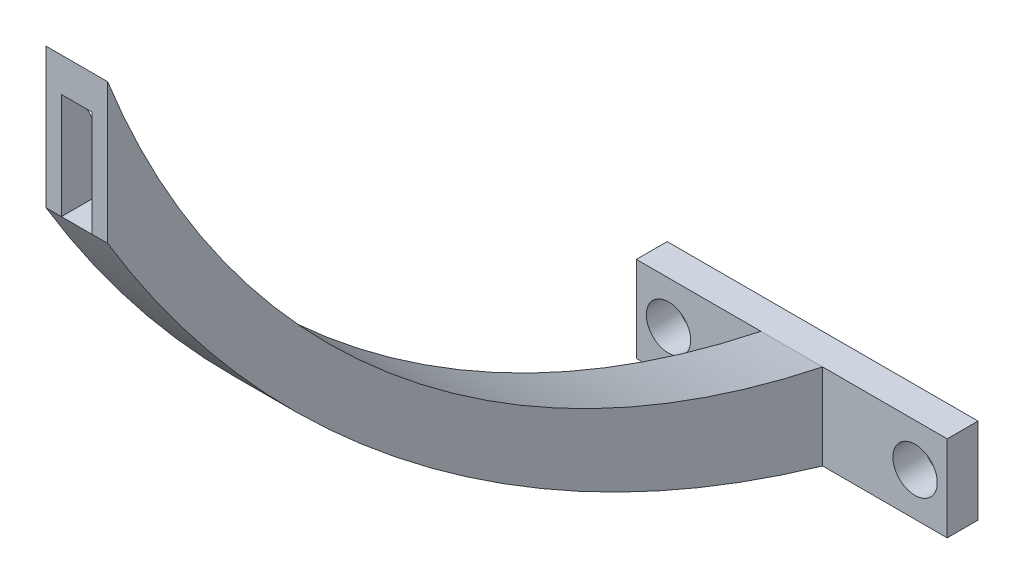
ISO-10303-21;
HEADER;
FILE_DESCRIPTION(('STEP AP214'),'2;1');
FILE_NAME('part.step','',(''),(''),'','','');
FILE_SCHEMA(('AUTOMOTIVE_DESIGN { 1 0 10303 214 1 1 1 1 }'));
ENDSEC;
DATA;
#1=APPLICATION_CONTEXT('core data for automotive mechanical design processes');
#2=APPLICATION_PROTOCOL_DEFINITION('international standard','automotive_design',2000,#1);
#3=PRODUCT_CONTEXT('',#1,'mechanical');
#4=PRODUCT('Part','Part','',(#3));
#5=PRODUCT_RELATED_PRODUCT_CATEGORY('part','',(#4));
#6=PRODUCT_DEFINITION_FORMATION('','',#4);
#7=PRODUCT_DEFINITION_CONTEXT('part definition',#1,'design');
#8=PRODUCT_DEFINITION('design','',#6,#7);
#9=PRODUCT_DEFINITION_SHAPE('','',#8);
#10=(LENGTH_UNIT() NAMED_UNIT(*) SI_UNIT(.MILLI.,.METRE.));
#11=(NAMED_UNIT(*) PLANE_ANGLE_UNIT() SI_UNIT($,.RADIAN.));
#12=(NAMED_UNIT(*) SI_UNIT($,.STERADIAN.) SOLID_ANGLE_UNIT());
#13=UNCERTAINTY_MEASURE_WITH_UNIT(LENGTH_MEASURE(1.E-05),#10,'distance_accuracy_value','');
#14=(GEOMETRIC_REPRESENTATION_CONTEXT(3) GLOBAL_UNCERTAINTY_ASSIGNED_CONTEXT((#13)) GLOBAL_UNIT_ASSIGNED_CONTEXT((#10,
#11,#12)) REPRESENTATION_CONTEXT('',''));
#15=CARTESIAN_POINT('',(0.,0.,0.));
#16=DIRECTION('',(0.,0.,1.));
#17=DIRECTION('',(1.,0.,0.));
#18=AXIS2_PLACEMENT_3D('',#15,#16,#17);
#19=CARTESIAN_POINT('',(1.58750000000001,0.,2.54));
#20=DIRECTION('',(-1.,0.,0.));
#21=DIRECTION('',(0.,0.,1.));
#22=AXIS2_PLACEMENT_3D('',#19,#20,#21);
#23=PLANE('',#22);
#24=DIRECTION('',(0.,0.,-1.));
#25=VECTOR('',#24,1.);
#26=CARTESIAN_POINT('',(1.58750000000001,67.5961503717204,73.66));
#27=LINE('',#26,#25);
#28=CARTESIAN_POINT('',(1.58750000000001,67.5961503717204,73.66));
#29=VERTEX_POINT('',#28);
#30=CARTESIAN_POINT('',(1.58750000000001,67.5961503717204,72.2017926374648));
#31=VERTEX_POINT('',#30);
#32=EDGE_CURVE('E159',#29,#31,#27,.T.);
#33=ORIENTED_EDGE('',*,*,#32,.F.);
#34=DIRECTION('',(0.,-1.,0.));
#35=VECTOR('',#34,1.);
#36=CARTESIAN_POINT('',(1.58750000000001,0.,73.66));
#37=LINE('',#36,#35);
#38=CARTESIAN_POINT('',(1.58750000000001,56.697947674241,73.66));
#39=VERTEX_POINT('',#38);
#40=EDGE_CURVE('E148',#29,#39,#37,.T.);
#41=ORIENTED_EDGE('',*,*,#40,.T.);
#42=DIRECTION('',(0.,0.,1.));
#43=VECTOR('',#42,1.);
#44=CARTESIAN_POINT('',(1.58750000000001,56.697947674241,2.54));
#45=LINE('',#44,#43);
#46=CARTESIAN_POINT('',(1.58750000000001,56.697947674241,66.6457203813951));
#47=VERTEX_POINT('',#46);
#48=EDGE_CURVE('E226',#47,#39,#45,.T.);
#49=ORIENTED_EDGE('',*,*,#48,.F.);
#50=CARTESIAN_POINT('',(1.58750000000001,108.146776817647,-20.8044360752679));
#51=DIRECTION('',(-1.,0.,0.));
#52=DIRECTION('',(0.,0.,1.));
#53=AXIS2_PLACEMENT_3D('',#50,#51,#52);
#54=CIRCLE('',#53,101.461874044008);
#55=EDGE_CURVE('E61',#31,#47,#54,.F.);
#56=ORIENTED_EDGE('',*,*,#55,.F.);
#57=EDGE_LOOP('',(#33,#41,#49,#56));
#58=FACE_BOUND('',#57,.T.);
#59=ADVANCED_FACE('F53',(#58),#23,.F.);
#60=CARTESIAN_POINT('',(4.76250000000003,0.,2.54));
#61=DIRECTION('',(-1.,0.,0.));
#62=DIRECTION('',(0.,-1.,0.));
#63=AXIS2_PLACEMENT_3D('',#60,#61,#62);
#64=PLANE('',#63);
#65=DIRECTION('',(0.,-1.,0.));
#66=VECTOR('',#65,1.);
#67=CARTESIAN_POINT('',(4.76250000000003,0.,73.66));
#68=LINE('',#67,#66);
#69=CARTESIAN_POINT('',(4.76250000000001,67.5961503717204,73.66));
#70=VERTEX_POINT('',#69);
#71=CARTESIAN_POINT('',(4.76250000000001,56.697947674241,73.66));
#72=VERTEX_POINT('',#71);
#73=EDGE_CURVE('E156',#70,#72,#68,.T.);
#74=ORIENTED_EDGE('',*,*,#73,.F.);
#75=DIRECTION('',(0.,0.,1.));
#76=VECTOR('',#75,1.);
#77=CARTESIAN_POINT('',(4.76250000000001,67.5961503717204,73.66));
#78=LINE('',#77,#76);
#79=CARTESIAN_POINT('',(4.76250000000001,67.5961503717204,72.2017926374648));
#80=VERTEX_POINT('',#79);
#81=EDGE_CURVE('E74',#80,#70,#78,.T.);
#82=ORIENTED_EDGE('',*,*,#81,.F.);
#83=CARTESIAN_POINT('',(4.7625,108.146776817647,-20.8044360752679));
#84=DIRECTION('',(-1.,0.,0.));
#85=DIRECTION('',(0.,-1.,0.));
#86=AXIS2_PLACEMENT_3D('',#83,#84,#85);
#87=CIRCLE('',#86,101.461874044008);
#88=CARTESIAN_POINT('',(4.76250000000002,56.697947674241,66.6457203813951));
#89=VERTEX_POINT('',#88);
#90=EDGE_CURVE('E261',#80,#89,#87,.F.);
#91=ORIENTED_EDGE('',*,*,#90,.T.);
#92=DIRECTION('',(0.,0.,1.));
#93=VECTOR('',#92,1.);
#94=CARTESIAN_POINT('',(4.76250000000001,56.697947674241,2.54));
#95=LINE('',#94,#93);
#96=EDGE_CURVE('E155',#89,#72,#95,.T.);
#97=ORIENTED_EDGE('',*,*,#96,.T.);
#98=EDGE_LOOP('',(#74,#82,#91,#97));
#99=FACE_BOUND('',#98,.T.);
#100=ADVANCED_FACE('F276',(#99),#64,.T.);
#101=CARTESIAN_POINT('',(0.,71.12,0.));
#102=DIRECTION('',(1.,0.,0.));
#103=DIRECTION('',(0.,0.,-1.));
#104=AXIS2_PLACEMENT_3D('',#101,#102,#103);
#105=PLANE('',#104);
#106=DIRECTION('',(0.,-1.,0.));
#107=VECTOR('',#106,1.);
#108=CARTESIAN_POINT('',(0.,71.12,73.66));
#109=LINE('',#108,#107);
#110=CARTESIAN_POINT('',(0.,71.12,73.66));
#111=VERTEX_POINT('',#110);
#112=CARTESIAN_POINT('',(0.,56.697947674241,73.66));
#113=VERTEX_POINT('',#112);
#114=EDGE_CURVE('E259',#111,#113,#109,.T.);
#115=ORIENTED_EDGE('',*,*,#114,.F.);
#116=CARTESIAN_POINT('',(0.,108.146776817647,-20.8044360752679));
#117=DIRECTION('',(1.,0.,0.));
#118=DIRECTION('',(0.,0.,-1.));
#119=AXIS2_PLACEMENT_3D('',#116,#117,#118);
#120=CIRCLE('',#119,101.461874044008);
#121=CARTESIAN_POINT('',(0.,8.84074817833277,0.));
#122=VERTEX_POINT('',#121);
#123=EDGE_CURVE('E241',#111,#122,#120,.T.);
#124=ORIENTED_EDGE('',*,*,#123,.T.);
#125=DIRECTION('',(0.,-1.,0.));
#126=VECTOR('',#125,1.);
#127=CARTESIAN_POINT('',(0.,71.12,0.));
#128=LINE('',#127,#126);
#129=CARTESIAN_POINT('',(0.,0.,0.));
#130=VERTEX_POINT('',#129);
#131=EDGE_CURVE('E247',#122,#130,#128,.T.);
#132=ORIENTED_EDGE('',*,*,#131,.T.);
#133=CARTESIAN_POINT('',(0.,122.26025229399,-35.4558641320756));
#134=DIRECTION('',(1.,0.,0.));
#135=DIRECTION('',(0.,0.,-1.));
#136=AXIS2_PLACEMENT_3D('',#133,#134,#135);
#137=CIRCLE('',#136,127.297633883519);
#138=EDGE_CURVE('E239',#113,#130,#137,.T.);
#139=ORIENTED_EDGE('',*,*,#138,.F.);
#140=EDGE_LOOP('',(#115,#124,#132,#139));
#141=FACE_BOUND('',#140,.T.);
#142=ADVANCED_FACE('F55',(#141),#105,.F.);
#143=CARTESIAN_POINT('',(0.,71.12,73.66));
#144=DIRECTION('',(0.,0.,-1.));
#145=DIRECTION('',(-1.,0.,0.));
#146=AXIS2_PLACEMENT_3D('',#143,#144,#145);
#147=PLANE('',#146);
#148=DIRECTION('',(1.,0.,0.));
#149=VECTOR('',#148,1.);
#150=CARTESIAN_POINT('',(-64.77,56.697947674241,73.66));
#151=LINE('',#150,#149);
#152=EDGE_CURVE('E153',#113,#39,#151,.T.);
#153=ORIENTED_EDGE('',*,*,#152,.T.);
#154=ORIENTED_EDGE('',*,*,#40,.F.);
#155=DIRECTION('',(-1.,0.,0.));
#156=VECTOR('',#155,1.);
#157=CARTESIAN_POINT('',(8.57614457112592,67.5961503717204,73.66));
#158=LINE('',#157,#156);
#159=EDGE_CURVE('E150',#70,#29,#158,.T.);
#160=ORIENTED_EDGE('',*,*,#159,.F.);
#161=ORIENTED_EDGE('',*,*,#73,.T.);
#162=CARTESIAN_POINT('',(6.35000000000001,56.697947674241,73.66));
#163=VERTEX_POINT('',#162);
#164=EDGE_CURVE('E237',#72,#163,#151,.T.);
#165=ORIENTED_EDGE('',*,*,#164,.T.);
#166=DIRECTION('',(0.,-1.,0.));
#167=VECTOR('',#166,1.);
#168=CARTESIAN_POINT('',(6.35000000000001,71.12,73.66));
#169=LINE('',#168,#167);
#170=CARTESIAN_POINT('',(6.35000000000001,71.12,73.66));
#171=VERTEX_POINT('',#170);
#172=EDGE_CURVE('E256',#171,#163,#169,.T.);
#173=ORIENTED_EDGE('',*,*,#172,.F.);
#174=DIRECTION('',(1.,0.,0.));
#175=VECTOR('',#174,1.);
#176=CARTESIAN_POINT('',(0.,71.12,73.66));
#177=LINE('',#176,#175);
#178=CARTESIAN_POINT('',(4.76250000000001,71.12,73.66));
#179=VERTEX_POINT('',#178);
#180=EDGE_CURVE('E248',#179,#171,#177,.T.);
#181=ORIENTED_EDGE('',*,*,#180,.F.);
#182=DIRECTION('',(-1.,0.,0.));
#183=VECTOR('',#182,1.);
#184=CARTESIAN_POINT('',(8.57614457112592,71.12,73.66));
#185=LINE('',#184,#183);
#186=CARTESIAN_POINT('',(1.58750000000001,71.12,73.66));
#187=VERTEX_POINT('',#186);
#188=EDGE_CURVE('E170',#179,#187,#185,.T.);
#189=ORIENTED_EDGE('',*,*,#188,.T.);
#190=EDGE_CURVE('E245',#111,#187,#177,.T.);
#191=ORIENTED_EDGE('',*,*,#190,.F.);
#192=ORIENTED_EDGE('',*,*,#114,.T.);
#193=EDGE_LOOP('',(#153,#154,#160,#161,#165,#173,#181,#189,#191,#192));
#194=FACE_BOUND('',#193,.T.);
#195=ADVANCED_FACE('F149',(#194),#147,.F.);
#196=CARTESIAN_POINT('',(6.35,71.12,0.));
#197=DIRECTION('',(-1.,0.,0.));
#198=DIRECTION('',(0.,0.,1.));
#199=AXIS2_PLACEMENT_3D('',#196,#197,#198);
#200=PLANE('',#199);
#201=DIRECTION('',(0.,-1.,0.));
#202=VECTOR('',#201,1.);
#203=CARTESIAN_POINT('',(6.35,71.12,0.));
#204=LINE('',#203,#202);
#205=CARTESIAN_POINT('',(6.35,8.84074817833277,0.));
#206=VERTEX_POINT('',#205);
#207=CARTESIAN_POINT('',(6.35,0.,0.));
#208=VERTEX_POINT('',#207);
#209=EDGE_CURVE('E253',#206,#208,#204,.T.);
#210=ORIENTED_EDGE('',*,*,#209,.F.);
#211=CARTESIAN_POINT('',(6.35,108.146776817647,-20.8044360752679));
#212=DIRECTION('',(1.,0.,0.));
#213=DIRECTION('',(0.,0.,-1.));
#214=AXIS2_PLACEMENT_3D('',#211,#212,#213);
#215=CIRCLE('',#214,101.461874044008);
#216=EDGE_CURVE('E228',#171,#206,#215,.T.);
#217=ORIENTED_EDGE('',*,*,#216,.F.);
#218=ORIENTED_EDGE('',*,*,#172,.T.);
#219=CARTESIAN_POINT('',(6.35,122.26025229399,-35.4558641320756));
#220=DIRECTION('',(1.,0.,0.));
#221=DIRECTION('',(0.,0.,-1.));
#222=AXIS2_PLACEMENT_3D('',#219,#220,#221);
#223=CIRCLE('',#222,127.297633883519);
#224=EDGE_CURVE('E235',#163,#208,#223,.T.);
#225=ORIENTED_EDGE('',*,*,#224,.T.);
#226=EDGE_LOOP('',(#210,#217,#218,#225));
#227=FACE_BOUND('',#226,.T.);
#228=ADVANCED_FACE('F289',(#227),#200,.F.);
#229=CARTESIAN_POINT('',(-64.77,122.26025229399,-35.4558641320756));
#230=DIRECTION('',(1.,0.,0.));
#231=DIRECTION('',(0.,0.,-1.));
#232=AXIS2_PLACEMENT_3D('',#229,#230,#231);
#233=CYLINDRICAL_SURFACE('',#232,127.297633883519);
#234=ORIENTED_EDGE('',*,*,#138,.T.);
#235=DIRECTION('',(-1.,0.,0.));
#236=VECTOR('',#235,1.);
#237=CARTESIAN_POINT('',(0.,0.,0.));
#238=LINE('',#237,#236);
#239=EDGE_CURVE('E244',#208,#130,#238,.T.);
#240=ORIENTED_EDGE('',*,*,#239,.F.);
#241=ORIENTED_EDGE('',*,*,#224,.F.);
#242=ORIENTED_EDGE('',*,*,#164,.F.);
#243=DIRECTION('',(1.,0.,0.));
#244=VECTOR('',#243,1.);
#245=CARTESIAN_POINT('',(0.,56.697947674241,73.66));
#246=LINE('',#245,#244);
#247=EDGE_CURVE('E222',#39,#72,#246,.T.);
#248=ORIENTED_EDGE('',*,*,#247,.F.);
#249=ORIENTED_EDGE('',*,*,#152,.F.);
#250=EDGE_LOOP('',(#234,#240,#241,#242,#248,#249));
#251=FACE_BOUND('',#250,.T.);
#252=ADVANCED_FACE('F312',(#251),#233,.T.);
#253=CARTESIAN_POINT('',(-64.77,108.146776817647,-20.8044360752679));
#254=DIRECTION('',(1.,0.,0.));
#255=DIRECTION('',(0.,0.,-1.));
#256=AXIS2_PLACEMENT_3D('',#253,#254,#255);
#257=CYLINDRICAL_SURFACE('',#256,101.461874044008);
#258=ORIENTED_EDGE('',*,*,#190,.T.);
#259=EDGE_CURVE('E12',#187,#31,#54,.F.);
#260=ORIENTED_EDGE('',*,*,#259,.T.);
#261=ORIENTED_EDGE('',*,*,#55,.T.);
#262=DIRECTION('',(1.,0.,0.));
#263=VECTOR('',#262,1.);
#264=CARTESIAN_POINT('',(-64.77,56.697947674241,66.6457203813951));
#265=LINE('',#264,#263);
#266=EDGE_CURVE('E263',#47,#89,#265,.T.);
#267=ORIENTED_EDGE('',*,*,#266,.T.);
#268=ORIENTED_EDGE('',*,*,#90,.F.);
#269=EDGE_CURVE('E262',#179,#80,#87,.F.);
#270=ORIENTED_EDGE('',*,*,#269,.F.);
#271=ORIENTED_EDGE('',*,*,#180,.T.);
#272=ORIENTED_EDGE('',*,*,#216,.T.);
#273=DIRECTION('',(1.,0.,0.));
#274=VECTOR('',#273,1.);
#275=CARTESIAN_POINT('',(-64.77,8.84074817833277,0.));
#276=LINE('',#275,#274);
#277=EDGE_CURVE('E232',#122,#206,#276,.T.);
#278=ORIENTED_EDGE('',*,*,#277,.F.);
#279=ORIENTED_EDGE('',*,*,#123,.F.);
#280=EDGE_LOOP('',(#258,#260,#261,#267,#268,#270,#271,#272,#278,#279));
#281=FACE_BOUND('',#280,.T.);
#282=ADVANCED_FACE('F268',(#281),#257,.F.);
#283=CARTESIAN_POINT('',(0.,56.697947674241,2.54));
#284=DIRECTION('',(0.,-1.,0.));
#285=DIRECTION('',(0.,0.,-1.));
#286=AXIS2_PLACEMENT_3D('',#283,#284,#285);
#287=PLANE('',#286);
#288=ORIENTED_EDGE('',*,*,#48,.T.);
#289=ORIENTED_EDGE('',*,*,#247,.T.);
#290=ORIENTED_EDGE('',*,*,#96,.F.);
#291=ORIENTED_EDGE('',*,*,#266,.F.);
#292=EDGE_LOOP('',(#288,#289,#290,#291));
#293=FACE_BOUND('',#292,.T.);
#294=ADVANCED_FACE('F272',(#293),#287,.F.);
#295=CARTESIAN_POINT('',(0.,0.,0.));
#296=DIRECTION('',(0.,0.,-1.));
#297=DIRECTION('',(-1.,0.,0.));
#298=AXIS2_PLACEMENT_3D('',#295,#296,#297);
#299=PLANE('',#298);
#300=CARTESIAN_POINT('',(15.875,4.42037408916639,0.));
#301=DIRECTION('',(0.,0.,-1.));
#302=DIRECTION('',(-1.,0.,0.));
#303=AXIS2_PLACEMENT_3D('',#300,#301,#302);
#304=CIRCLE('',#303,2.286);
#305=CARTESIAN_POINT('',(13.589,4.42037408916639,0.));
#306=VERTEX_POINT('',#305);
#307=EDGE_CURVE('E207',#306,#306,#304,.T.);
#308=ORIENTED_EDGE('',*,*,#307,.T.);
#309=EDGE_LOOP('',(#308));
#310=FACE_BOUND('',#309,.T.);
#311=DIRECTION('',(1.,0.,0.));
#312=VECTOR('',#311,1.);
#313=CARTESIAN_POINT('',(0.,8.84074817833277,0.));
#314=LINE('',#313,#312);
#315=CARTESIAN_POINT('',(19.1866851716327,8.84074817833277,0.));
#316=VERTEX_POINT('',#315);
#317=EDGE_CURVE('E196',#206,#316,#314,.T.);
#318=ORIENTED_EDGE('',*,*,#317,.F.);
#319=ORIENTED_EDGE('',*,*,#209,.T.);
#320=DIRECTION('',(1.,0.,0.));
#321=VECTOR('',#320,1.);
#322=CARTESIAN_POINT('',(0.,0.,0.));
#323=LINE('',#322,#321);
#324=CARTESIAN_POINT('',(19.1866851716327,0.,0.));
#325=VERTEX_POINT('',#324);
#326=EDGE_CURVE('E203',#208,#325,#323,.T.);
#327=ORIENTED_EDGE('',*,*,#326,.T.);
#328=DIRECTION('',(0.,1.,0.));
#329=VECTOR('',#328,1.);
#330=CARTESIAN_POINT('',(19.1866851716327,0.,0.));
#331=LINE('',#330,#329);
#332=EDGE_CURVE('E200',#325,#316,#331,.T.);
#333=ORIENTED_EDGE('',*,*,#332,.T.);
#334=EDGE_LOOP('',(#318,#319,#327,#333));
#335=FACE_BOUND('',#334,.T.);
#336=ADVANCED_FACE('F314',(#310,#335),#299,.F.);
#337=CARTESIAN_POINT('',(-12.8366851716327,0.,-3.175));
#338=DIRECTION('',(1.,0.,0.));
#339=DIRECTION('',(0.,0.,-1.));
#340=AXIS2_PLACEMENT_3D('',#337,#338,#339);
#341=PLANE('',#340);
#342=DIRECTION('',(0.,1.,0.));
#343=VECTOR('',#342,1.);
#344=CARTESIAN_POINT('',(-12.8366851716327,0.,0.));
#345=LINE('',#344,#343);
#346=CARTESIAN_POINT('',(-12.8366851716327,0.,0.));
#347=VERTEX_POINT('',#346);
#348=CARTESIAN_POINT('',(-12.8366851716327,8.84074817833277,0.));
#349=VERTEX_POINT('',#348);
#350=EDGE_CURVE('E193',#347,#349,#345,.T.);
#351=ORIENTED_EDGE('',*,*,#350,.T.);
#352=DIRECTION('',(0.,0.,1.));
#353=VECTOR('',#352,1.);
#354=CARTESIAN_POINT('',(-12.8366851716327,8.84074817833277,-3.175));
#355=LINE('',#354,#353);
#356=CARTESIAN_POINT('',(-12.8366851716327,8.84074817833277,-3.175));
#357=VERTEX_POINT('',#356);
#358=EDGE_CURVE('E219',#357,#349,#355,.T.);
#359=ORIENTED_EDGE('',*,*,#358,.F.);
#360=DIRECTION('',(0.,1.,0.));
#361=VECTOR('',#360,1.);
#362=CARTESIAN_POINT('',(-12.8366851716327,0.,-3.175));
#363=LINE('',#362,#361);
#364=CARTESIAN_POINT('',(-12.8366851716327,0.,-3.175));
#365=VERTEX_POINT('',#364);
#366=EDGE_CURVE('E174',#365,#357,#363,.T.);
#367=ORIENTED_EDGE('',*,*,#366,.F.);
#368=DIRECTION('',(0.,0.,1.));
#369=VECTOR('',#368,1.);
#370=CARTESIAN_POINT('',(-12.8366851716327,0.,-3.175));
#371=LINE('',#370,#369);
#372=EDGE_CURVE('E192',#365,#347,#371,.T.);
#373=ORIENTED_EDGE('',*,*,#372,.T.);
#374=EDGE_LOOP('',(#351,#359,#367,#373));
#375=FACE_BOUND('',#374,.T.);
#376=ADVANCED_FACE('F307',(#375),#341,.F.);
#377=CARTESIAN_POINT('',(0.,8.84074817833277,-3.175));
#378=DIRECTION('',(0.,-1.,0.));
#379=DIRECTION('',(0.,0.,-1.));
#380=AXIS2_PLACEMENT_3D('',#377,#378,#379);
#381=PLANE('',#380);
#382=EDGE_CURVE('E197',#349,#122,#314,.T.);
#383=ORIENTED_EDGE('',*,*,#382,.T.);
#384=ORIENTED_EDGE('',*,*,#277,.T.);
#385=ORIENTED_EDGE('',*,*,#317,.T.);
#386=DIRECTION('',(0.,0.,1.));
#387=VECTOR('',#386,1.);
#388=CARTESIAN_POINT('',(19.1866851716327,8.84074817833277,-3.175));
#389=LINE('',#388,#387);
#390=CARTESIAN_POINT('',(19.1866851716327,8.84074817833277,-3.175));
#391=VERTEX_POINT('',#390);
#392=EDGE_CURVE('E216',#391,#316,#389,.T.);
#393=ORIENTED_EDGE('',*,*,#392,.F.);
#394=DIRECTION('',(1.,0.,0.));
#395=VECTOR('',#394,1.);
#396=CARTESIAN_POINT('',(0.,8.84074817833277,-3.175));
#397=LINE('',#396,#395);
#398=EDGE_CURVE('E177',#357,#391,#397,.T.);
#399=ORIENTED_EDGE('',*,*,#398,.F.);
#400=ORIENTED_EDGE('',*,*,#358,.T.);
#401=EDGE_LOOP('',(#383,#384,#385,#393,#399,#400));
#402=FACE_BOUND('',#401,.T.);
#403=ADVANCED_FACE('F302',(#402),#381,.F.);
#404=CARTESIAN_POINT('',(19.1866851716327,0.,-3.175));
#405=DIRECTION('',(1.,0.,0.));
#406=DIRECTION('',(0.,0.,-1.));
#407=AXIS2_PLACEMENT_3D('',#404,#405,#406);
#408=PLANE('',#407);
#409=ORIENTED_EDGE('',*,*,#332,.F.);
#410=DIRECTION('',(0.,0.,1.));
#411=VECTOR('',#410,1.);
#412=CARTESIAN_POINT('',(19.1866851716327,0.,-3.175));
#413=LINE('',#412,#411);
#414=CARTESIAN_POINT('',(19.1866851716327,0.,-3.175));
#415=VERTEX_POINT('',#414);
#416=EDGE_CURVE('E213',#415,#325,#413,.T.);
#417=ORIENTED_EDGE('',*,*,#416,.F.);
#418=DIRECTION('',(0.,1.,0.));
#419=VECTOR('',#418,1.);
#420=CARTESIAN_POINT('',(19.1866851716327,0.,-3.175));
#421=LINE('',#420,#419);
#422=EDGE_CURVE('E180',#415,#391,#421,.T.);
#423=ORIENTED_EDGE('',*,*,#422,.T.);
#424=ORIENTED_EDGE('',*,*,#392,.T.);
#425=EDGE_LOOP('',(#409,#417,#423,#424));
#426=FACE_BOUND('',#425,.T.);
#427=ADVANCED_FACE('F317',(#426),#408,.T.);
#428=CARTESIAN_POINT('',(15.875,4.42037408916639,-3.175));
#429=DIRECTION('',(0.,0.,1.));
#430=DIRECTION('',(1.,0.,0.));
#431=AXIS2_PLACEMENT_3D('',#428,#429,#430);
#432=CYLINDRICAL_SURFACE('',#431,2.286);
#433=CARTESIAN_POINT('',(15.875,4.42037408916639,-3.175));
#434=DIRECTION('',(0.,0.,-1.));
#435=DIRECTION('',(-1.,0.,0.));
#436=AXIS2_PLACEMENT_3D('',#433,#434,#435);
#437=CIRCLE('',#436,2.286);
#438=CARTESIAN_POINT('',(13.589,4.42037408916639,-3.175));
#439=VERTEX_POINT('',#438);
#440=EDGE_CURVE('E186',#439,#439,#437,.T.);
#441=ORIENTED_EDGE('',*,*,#440,.T.);
#442=EDGE_LOOP('',(#441));
#443=FACE_BOUND('',#442,.T.);
#444=ORIENTED_EDGE('',*,*,#307,.F.);
#445=EDGE_LOOP('',(#444));
#446=FACE_BOUND('',#445,.T.);
#447=ADVANCED_FACE('F451',(#443,#446),#432,.F.);
#448=CARTESIAN_POINT('',(0.,0.,-3.175));
#449=DIRECTION('',(0.,-1.,0.));
#450=DIRECTION('',(1.,0.,0.));
#451=AXIS2_PLACEMENT_3D('',#448,#449,#450);
#452=PLANE('',#451);
#453=EDGE_CURVE('E204',#347,#130,#323,.T.);
#454=ORIENTED_EDGE('',*,*,#453,.F.);
#455=ORIENTED_EDGE('',*,*,#372,.F.);
#456=DIRECTION('',(1.,0.,0.));
#457=VECTOR('',#456,1.);
#458=CARTESIAN_POINT('',(0.,0.,-3.175));
#459=LINE('',#458,#457);
#460=EDGE_CURVE('E183',#365,#415,#459,.T.);
#461=ORIENTED_EDGE('',*,*,#460,.T.);
#462=ORIENTED_EDGE('',*,*,#416,.T.);
#463=ORIENTED_EDGE('',*,*,#326,.F.);
#464=ORIENTED_EDGE('',*,*,#239,.T.);
#465=EDGE_LOOP('',(#454,#455,#461,#462,#463,#464));
#466=FACE_BOUND('',#465,.T.);
#467=ADVANCED_FACE('F309',(#466),#452,.T.);
#468=CARTESIAN_POINT('',(-9.525,4.42037408916639,-3.175));
#469=DIRECTION('',(0.,0.,1.));
#470=DIRECTION('',(1.,0.,0.));
#471=AXIS2_PLACEMENT_3D('',#468,#469,#470);
#472=CYLINDRICAL_SURFACE('',#471,2.286);
#473=CARTESIAN_POINT('',(-9.525,4.42037408916639,-3.175));
#474=DIRECTION('',(0.,0.,-1.));
#475=DIRECTION('',(-1.,0.,0.));
#476=AXIS2_PLACEMENT_3D('',#473,#474,#475);
#477=CIRCLE('',#476,2.286);
#478=CARTESIAN_POINT('',(-11.811,4.42037408916639,-3.175));
#479=VERTEX_POINT('',#478);
#480=EDGE_CURVE('E189',#479,#479,#477,.F.);
#481=ORIENTED_EDGE('',*,*,#480,.F.);
#482=EDGE_LOOP('',(#481));
#483=FACE_BOUND('',#482,.T.);
#484=CARTESIAN_POINT('',(-9.525,4.42037408916639,0.));
#485=DIRECTION('',(0.,0.,-1.));
#486=DIRECTION('',(-1.,0.,0.));
#487=AXIS2_PLACEMENT_3D('',#484,#485,#486);
#488=CIRCLE('',#487,2.286);
#489=CARTESIAN_POINT('',(-11.811,4.42037408916639,0.));
#490=VERTEX_POINT('',#489);
#491=EDGE_CURVE('E178',#490,#490,#488,.F.);
#492=ORIENTED_EDGE('',*,*,#491,.T.);
#493=EDGE_LOOP('',(#492));
#494=FACE_BOUND('',#493,.T.);
#495=ADVANCED_FACE('F324',(#483,#494),#472,.F.);
#496=CARTESIAN_POINT('',(0.,0.,-3.175));
#497=DIRECTION('',(0.,0.,-1.));
#498=DIRECTION('',(-1.,0.,0.));
#499=AXIS2_PLACEMENT_3D('',#496,#497,#498);
#500=PLANE('',#499);
#501=ORIENTED_EDGE('',*,*,#366,.T.);
#502=ORIENTED_EDGE('',*,*,#398,.T.);
#503=ORIENTED_EDGE('',*,*,#422,.F.);
#504=ORIENTED_EDGE('',*,*,#460,.F.);
#505=EDGE_LOOP('',(#501,#502,#503,#504));
#506=FACE_BOUND('',#505,.T.);
#507=ORIENTED_EDGE('',*,*,#440,.F.);
#508=EDGE_LOOP('',(#507));
#509=FACE_BOUND('',#508,.T.);
#510=ORIENTED_EDGE('',*,*,#480,.T.);
#511=EDGE_LOOP('',(#510));
#512=FACE_BOUND('',#511,.T.);
#513=ADVANCED_FACE('F321',(#506,#509,#512),#500,.T.);
#514=ORIENTED_EDGE('',*,*,#131,.F.);
#515=ORIENTED_EDGE('',*,*,#382,.F.);
#516=ORIENTED_EDGE('',*,*,#350,.F.);
#517=ORIENTED_EDGE('',*,*,#453,.T.);
#518=EDGE_LOOP('',(#514,#515,#516,#517));
#519=FACE_BOUND('',#518,.T.);
#520=ORIENTED_EDGE('',*,*,#491,.F.);
#521=EDGE_LOOP('',(#520));
#522=FACE_BOUND('',#521,.T.);
#523=ADVANCED_FACE('F298',(#519,#522),#299,.F.);
#524=CARTESIAN_POINT('',(1.58750000000001,0.,0.));
#525=DIRECTION('',(-1.,0.,0.));
#526=DIRECTION('',(0.,0.,1.));
#527=AXIS2_PLACEMENT_3D('',#524,#525,#526);
#528=PLANE('',#527);
#529=ORIENTED_EDGE('',*,*,#259,.F.);
#530=DIRECTION('',(0.,0.924011024771308,0.382365827580182));
#531=VECTOR('',#530,1.);
#532=CARTESIAN_POINT('',(1.58750000000001,71.12,73.66));
#533=LINE('',#532,#531);
#534=EDGE_CURVE('E161',#31,#187,#533,.T.);
#535=ORIENTED_EDGE('',*,*,#534,.F.);
#536=EDGE_LOOP('',(#529,#535));
#537=FACE_BOUND('',#536,.T.);
#538=ADVANCED_FACE('F335',(#537),#528,.T.);
#539=CARTESIAN_POINT('',(4.76250000000003,0.,2.54));
#540=DIRECTION('',(-1.,0.,0.));
#541=DIRECTION('',(0.,-1.,0.));
#542=AXIS2_PLACEMENT_3D('',#539,#540,#541);
#543=PLANE('',#542);
#544=DIRECTION('',(0.,-0.924011024771308,-0.382365827580182));
#545=VECTOR('',#544,1.);
#546=CARTESIAN_POINT('',(4.76250000000001,71.12,73.66));
#547=LINE('',#546,#545);
#548=EDGE_CURVE('E164',#179,#80,#547,.T.);
#549=ORIENTED_EDGE('',*,*,#548,.F.);
#550=ORIENTED_EDGE('',*,*,#269,.T.);
#551=EDGE_LOOP('',(#549,#550));
#552=FACE_BOUND('',#551,.T.);
#553=ADVANCED_FACE('F340',(#552),#543,.F.);
#554=CARTESIAN_POINT('',(8.57614457112592,71.12,73.66));
#555=DIRECTION('',(0.,-0.382365827580182,0.924011024771308));
#556=DIRECTION('',(0.,-0.924011024771308,-0.382365827580182));
#557=AXIS2_PLACEMENT_3D('',#554,#555,#556);
#558=PLANE('',#557);
#559=ORIENTED_EDGE('',*,*,#188,.F.);
#560=ORIENTED_EDGE('',*,*,#548,.T.);
#561=DIRECTION('',(-1.,0.,0.));
#562=VECTOR('',#561,1.);
#563=CARTESIAN_POINT('',(8.57614457112592,67.5961503717204,72.2017926374648));
#564=LINE('',#563,#562);
#565=EDGE_CURVE('E165',#80,#31,#564,.T.);
#566=ORIENTED_EDGE('',*,*,#565,.T.);
#567=ORIENTED_EDGE('',*,*,#534,.T.);
#568=EDGE_LOOP('',(#559,#560,#566,#567));
#569=FACE_BOUND('',#568,.T.);
#570=ADVANCED_FACE('F405',(#569),#558,.F.);
#571=CARTESIAN_POINT('',(8.57614457112592,67.5961503717204,73.66));
#572=DIRECTION('',(0.,1.,0.));
#573=DIRECTION('',(0.,0.,1.));
#574=AXIS2_PLACEMENT_3D('',#571,#572,#573);
#575=PLANE('',#574);
#576=ORIENTED_EDGE('',*,*,#565,.F.);
#577=ORIENTED_EDGE('',*,*,#81,.T.);
#578=ORIENTED_EDGE('',*,*,#159,.T.);
#579=ORIENTED_EDGE('',*,*,#32,.T.);
#580=EDGE_LOOP('',(#576,#577,#578,#579));
#581=FACE_BOUND('',#580,.T.);
#582=ADVANCED_FACE('F163',(#581),#575,.F.);
#583=CLOSED_SHELL('',(#59,#100,#142,#195,#228,#252,#282,#294,#336,#376,#403,#427,#447,#467,#495,
#513,#523,#538,#553,#570,#582));
#584=MANIFOLD_SOLID_BREP('B2',#583);
#585=ADVANCED_BREP_SHAPE_REPRESENTATION('',(#18,#584),#14);
#586=SHAPE_DEFINITION_REPRESENTATION(#9,#585);
ENDSEC;
END-ISO-10303-21;
